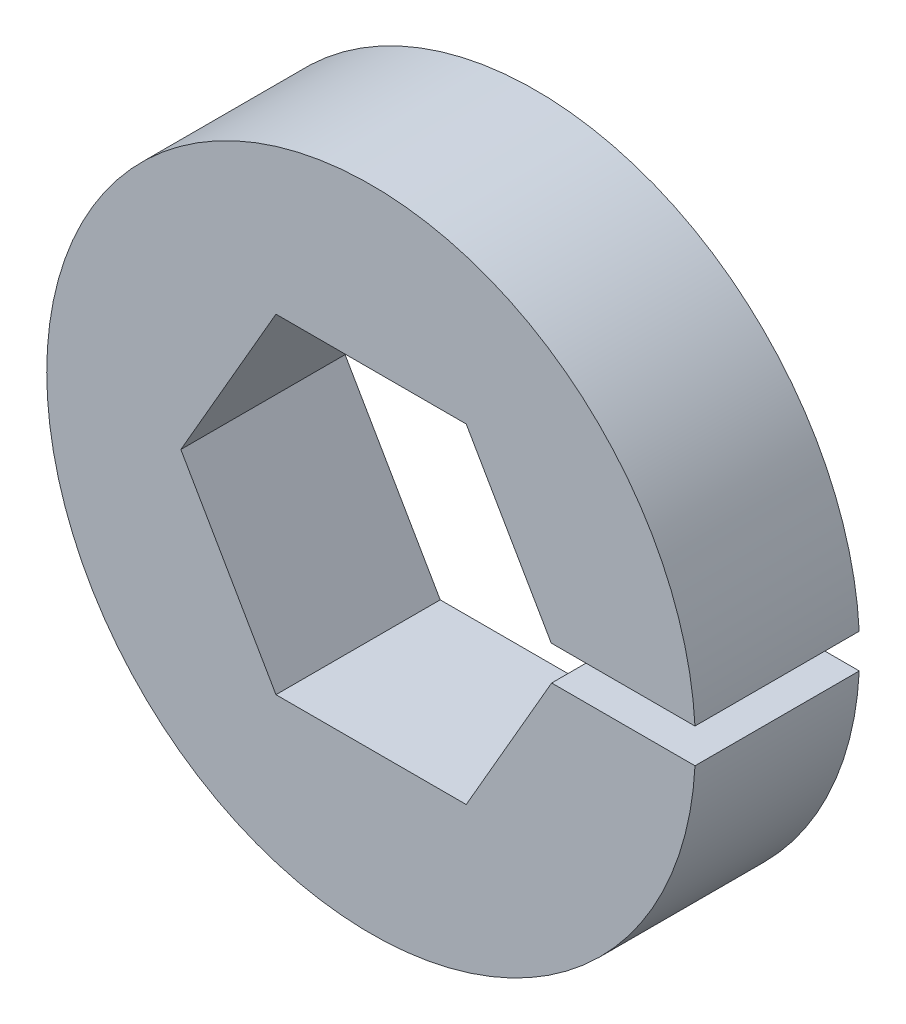
ISO-10303-21;
HEADER;
FILE_DESCRIPTION(('STEP AP214'),'2;1');
FILE_NAME('part.step','',(''),(''),'','','');
FILE_SCHEMA(('AUTOMOTIVE_DESIGN { 1 0 10303 214 1 1 1 1 }'));
ENDSEC;
DATA;
#1=APPLICATION_CONTEXT('core data for automotive mechanical design processes');
#2=APPLICATION_PROTOCOL_DEFINITION('international standard','automotive_design',2000,#1);
#3=PRODUCT_CONTEXT('',#1,'mechanical');
#4=PRODUCT('Part','Part','',(#3));
#5=PRODUCT_RELATED_PRODUCT_CATEGORY('part','',(#4));
#6=PRODUCT_DEFINITION_FORMATION('','',#4);
#7=PRODUCT_DEFINITION_CONTEXT('part definition',#1,'design');
#8=PRODUCT_DEFINITION('design','',#6,#7);
#9=PRODUCT_DEFINITION_SHAPE('','',#8);
#10=(LENGTH_UNIT() NAMED_UNIT(*) SI_UNIT(.MILLI.,.METRE.));
#11=(NAMED_UNIT(*) PLANE_ANGLE_UNIT() SI_UNIT($,.RADIAN.));
#12=(NAMED_UNIT(*) SI_UNIT($,.STERADIAN.) SOLID_ANGLE_UNIT());
#13=UNCERTAINTY_MEASURE_WITH_UNIT(LENGTH_MEASURE(1.E-05),#10,'distance_accuracy_value','');
#14=(GEOMETRIC_REPRESENTATION_CONTEXT(3) GLOBAL_UNCERTAINTY_ASSIGNED_CONTEXT((#13)) GLOBAL_UNIT_ASSIGNED_CONTEXT((#10,
#11,#12)) REPRESENTATION_CONTEXT('',''));
#15=CARTESIAN_POINT('',(0.,0.,0.));
#16=DIRECTION('',(0.,0.,1.));
#17=DIRECTION('',(1.,0.,0.));
#18=AXIS2_PLACEMENT_3D('',#15,#16,#17);
#19=CARTESIAN_POINT('',(0.,0.,6.33));
#20=DIRECTION('',(0.,0.,1.));
#21=DIRECTION('',(1.,0.,0.));
#22=AXIS2_PLACEMENT_3D('',#19,#20,#21);
#23=PLANE('',#22);
#24=DIRECTION('',(1.,0.,0.));
#25=VECTOR('',#24,1.);
#26=CARTESIAN_POINT('',(6.196229826958,-0.647680203586631,6.33));
#27=LINE('',#26,#25);
#28=CARTESIAN_POINT('',(6.95841007881871,-0.647680203586631,6.33));
#29=VERTEX_POINT('',#28);
#30=CARTESIAN_POINT('',(12.4832091368318,-0.647680203586631,6.33));
#31=VERTEX_POINT('',#30);
#32=EDGE_CURVE('E125',#29,#31,#27,.T.);
#33=ORIENTED_EDGE('',*,*,#32,.F.);
#34=DIRECTION('',(0.499999999999995,0.866025403784442,0.));
#35=VECTOR('',#34,1.);
#36=CARTESIAN_POINT('',(3.66617420935419,-6.34999999999995,6.33));
#37=LINE('',#36,#35);
#38=CARTESIAN_POINT('',(3.66617420935419,-6.34999999999995,6.33));
#39=VERTEX_POINT('',#38);
#40=EDGE_CURVE('E150',#39,#29,#37,.T.);
#41=ORIENTED_EDGE('',*,*,#40,.F.);
#42=DIRECTION('',(1.,0.,0.));
#43=VECTOR('',#42,1.);
#44=CARTESIAN_POINT('',(-3.66617420935406,-6.35000000000003,6.33));
#45=LINE('',#44,#43);
#46=CARTESIAN_POINT('',(-3.66617420935406,-6.35000000000003,6.33));
#47=VERTEX_POINT('',#46);
#48=EDGE_CURVE('E142',#47,#39,#45,.T.);
#49=ORIENTED_EDGE('',*,*,#48,.F.);
#50=DIRECTION('',(0.500000000000007,-0.866025403784434,0.));
#51=VECTOR('',#50,1.);
#52=CARTESIAN_POINT('',(-7.33234841870824,0.,6.33));
#53=LINE('',#52,#51);
#54=CARTESIAN_POINT('',(-7.33234841870824,0.,6.33));
#55=VERTEX_POINT('',#54);
#56=EDGE_CURVE('E161',#55,#47,#53,.T.);
#57=ORIENTED_EDGE('',*,*,#56,.F.);
#58=DIRECTION('',(-0.499999999999995,-0.866025403784441,0.));
#59=VECTOR('',#58,1.);
#60=CARTESIAN_POINT('',(-3.66617420935415,6.34999999999998,6.33));
#61=LINE('',#60,#59);
#62=CARTESIAN_POINT('',(-3.66617420935415,6.34999999999998,6.33));
#63=VERTEX_POINT('',#62);
#64=EDGE_CURVE('E168',#63,#55,#61,.T.);
#65=ORIENTED_EDGE('',*,*,#64,.F.);
#66=DIRECTION('',(-1.,0.,0.));
#67=VECTOR('',#66,1.);
#68=CARTESIAN_POINT('',(3.6661742093541,6.35,6.33));
#69=LINE('',#68,#67);
#70=CARTESIAN_POINT('',(3.6661742093541,6.35,6.33));
#71=VERTEX_POINT('',#70);
#72=EDGE_CURVE('E166',#71,#63,#69,.T.);
#73=ORIENTED_EDGE('',*,*,#72,.F.);
#74=DIRECTION('',(-0.500000000000001,0.866025403784438,0.));
#75=VECTOR('',#74,1.);
#76=CARTESIAN_POINT('',(7.33234841870824,0.,6.33));
#77=LINE('',#76,#75);
#78=CARTESIAN_POINT('',(6.94190411265604,0.676269375608385,6.33));
#79=VERTEX_POINT('',#78);
#80=EDGE_CURVE('E121',#79,#71,#77,.T.);
#81=ORIENTED_EDGE('',*,*,#80,.F.);
#82=DIRECTION('',(-1.,0.,0.));
#83=VECTOR('',#82,1.);
#84=CARTESIAN_POINT('',(6.196229826958,0.676269375608385,6.33));
#85=LINE('',#84,#83);
#86=CARTESIAN_POINT('',(12.4816929833903,0.676269375608385,6.33));
#87=VERTEX_POINT('',#86);
#88=EDGE_CURVE('E63',#87,#79,#85,.T.);
#89=ORIENTED_EDGE('',*,*,#88,.F.);
#90=CARTESIAN_POINT('',(0.,0.,6.33));
#91=DIRECTION('',(0.,0.,1.));
#92=DIRECTION('',(1.,0.,0.));
#93=AXIS2_PLACEMENT_3D('',#90,#91,#92);
#94=CIRCLE('',#93,12.5);
#95=EDGE_CURVE('E123',#87,#31,#94,.T.);
#96=ORIENTED_EDGE('',*,*,#95,.T.);
#97=EDGE_LOOP('',(#33,#41,#49,#57,#65,#73,#81,#89,#96));
#98=FACE_BOUND('',#97,.T.);
#99=ADVANCED_FACE('F39',(#98),#23,.T.);
#100=CARTESIAN_POINT('',(0.,0.,0.));
#101=DIRECTION('',(0.,0.,1.));
#102=DIRECTION('',(1.,0.,0.));
#103=AXIS2_PLACEMENT_3D('',#100,#101,#102);
#104=PLANE('',#103);
#105=CARTESIAN_POINT('',(0.,0.,0.));
#106=DIRECTION('',(0.,0.,1.));
#107=DIRECTION('',(1.,0.,0.));
#108=AXIS2_PLACEMENT_3D('',#105,#106,#107);
#109=CIRCLE('',#108,12.5);
#110=CARTESIAN_POINT('',(12.4816929833903,0.676269375608385,0.));
#111=VERTEX_POINT('',#110);
#112=CARTESIAN_POINT('',(12.4832091368318,-0.647680203586631,0.));
#113=VERTEX_POINT('',#112);
#114=EDGE_CURVE('E130',#111,#113,#109,.T.);
#115=ORIENTED_EDGE('',*,*,#114,.F.);
#116=DIRECTION('',(-1.,0.,0.));
#117=VECTOR('',#116,1.);
#118=CARTESIAN_POINT('',(6.196229826958,0.676269375608385,0.));
#119=LINE('',#118,#117);
#120=CARTESIAN_POINT('',(6.94190411265604,0.676269375608385,0.));
#121=VERTEX_POINT('',#120);
#122=EDGE_CURVE('E109',#111,#121,#119,.T.);
#123=ORIENTED_EDGE('',*,*,#122,.T.);
#124=DIRECTION('',(-0.500000000000001,0.866025403784438,0.));
#125=VECTOR('',#124,1.);
#126=CARTESIAN_POINT('',(7.33234841870824,0.,0.));
#127=LINE('',#126,#125);
#128=CARTESIAN_POINT('',(3.6661742093541,6.35,0.));
#129=VERTEX_POINT('',#128);
#130=EDGE_CURVE('E160',#121,#129,#127,.T.);
#131=ORIENTED_EDGE('',*,*,#130,.T.);
#132=DIRECTION('',(-1.,0.,0.));
#133=VECTOR('',#132,1.);
#134=CARTESIAN_POINT('',(3.6661742093541,6.35,0.));
#135=LINE('',#134,#133);
#136=CARTESIAN_POINT('',(-3.66617420935415,6.34999999999998,0.));
#137=VERTEX_POINT('',#136);
#138=EDGE_CURVE('E152',#129,#137,#135,.T.);
#139=ORIENTED_EDGE('',*,*,#138,.T.);
#140=DIRECTION('',(-0.499999999999995,-0.866025403784441,0.));
#141=VECTOR('',#140,1.);
#142=CARTESIAN_POINT('',(-3.66617420935415,6.34999999999998,0.));
#143=LINE('',#142,#141);
#144=CARTESIAN_POINT('',(-7.33234841870824,0.,0.));
#145=VERTEX_POINT('',#144);
#146=EDGE_CURVE('E153',#137,#145,#143,.T.);
#147=ORIENTED_EDGE('',*,*,#146,.T.);
#148=DIRECTION('',(0.500000000000007,-0.866025403784434,0.));
#149=VECTOR('',#148,1.);
#150=CARTESIAN_POINT('',(-7.33234841870824,0.,0.));
#151=LINE('',#150,#149);
#152=CARTESIAN_POINT('',(-3.66617420935406,-6.35000000000003,0.));
#153=VERTEX_POINT('',#152);
#154=EDGE_CURVE('E149',#145,#153,#151,.T.);
#155=ORIENTED_EDGE('',*,*,#154,.T.);
#156=DIRECTION('',(1.,0.,0.));
#157=VECTOR('',#156,1.);
#158=CARTESIAN_POINT('',(-3.66617420935406,-6.35000000000003,0.));
#159=LINE('',#158,#157);
#160=CARTESIAN_POINT('',(3.66617420935419,-6.34999999999995,0.));
#161=VERTEX_POINT('',#160);
#162=EDGE_CURVE('E143',#153,#161,#159,.T.);
#163=ORIENTED_EDGE('',*,*,#162,.T.);
#164=DIRECTION('',(0.499999999999995,0.866025403784442,0.));
#165=VECTOR('',#164,1.);
#166=CARTESIAN_POINT('',(3.66617420935419,-6.34999999999995,0.));
#167=LINE('',#166,#165);
#168=CARTESIAN_POINT('',(6.95841007881871,-0.64768020358663,0.));
#169=VERTEX_POINT('',#168);
#170=EDGE_CURVE('E159',#161,#169,#167,.T.);
#171=ORIENTED_EDGE('',*,*,#170,.T.);
#172=DIRECTION('',(1.,0.,0.));
#173=VECTOR('',#172,1.);
#174=CARTESIAN_POINT('',(6.196229826958,-0.647680203586631,0.));
#175=LINE('',#174,#173);
#176=EDGE_CURVE('E52',#169,#113,#175,.T.);
#177=ORIENTED_EDGE('',*,*,#176,.T.);
#178=EDGE_LOOP('',(#115,#123,#131,#139,#147,#155,#163,#171,#177));
#179=FACE_BOUND('',#178,.T.);
#180=ADVANCED_FACE('F180',(#179),#104,.F.);
#181=CARTESIAN_POINT('',(0.,0.,6.33));
#182=DIRECTION('',(0.,0.,-1.));
#183=DIRECTION('',(-1.,0.,0.));
#184=AXIS2_PLACEMENT_3D('',#181,#182,#183);
#185=CYLINDRICAL_SURFACE('',#184,12.5);
#186=ORIENTED_EDGE('',*,*,#95,.F.);
#187=DIRECTION('',(0.,0.,-1.));
#188=VECTOR('',#187,1.);
#189=CARTESIAN_POINT('',(12.4816929833903,0.676269375608385,6.33));
#190=LINE('',#189,#188);
#191=EDGE_CURVE('E110',#87,#111,#190,.T.);
#192=ORIENTED_EDGE('',*,*,#191,.T.);
#193=ORIENTED_EDGE('',*,*,#114,.T.);
#194=DIRECTION('',(0.,0.,-1.));
#195=VECTOR('',#194,1.);
#196=CARTESIAN_POINT('',(12.4832091368318,-0.647680203586631,6.33));
#197=LINE('',#196,#195);
#198=EDGE_CURVE('E113',#113,#31,#197,.F.);
#199=ORIENTED_EDGE('',*,*,#198,.T.);
#200=EDGE_LOOP('',(#186,#192,#193,#199));
#201=FACE_BOUND('',#200,.T.);
#202=ADVANCED_FACE('F41',(#201),#185,.T.);
#203=CARTESIAN_POINT('',(3.66617420935419,-6.34999999999995,6.33));
#204=DIRECTION('',(-0.866025403784441,0.499999999999995,0.));
#205=DIRECTION('',(-0.499999999999995,-0.866025403784441,0.));
#206=AXIS2_PLACEMENT_3D('',#203,#204,#205);
#207=PLANE('',#206);
#208=DIRECTION('',(0.,0.,1.));
#209=VECTOR('',#208,1.);
#210=CARTESIAN_POINT('',(6.95841007881871,-0.647680203586631,6.33));
#211=LINE('',#210,#209);
#212=EDGE_CURVE('E11',#169,#29,#211,.T.);
#213=ORIENTED_EDGE('',*,*,#212,.F.);
#214=ORIENTED_EDGE('',*,*,#170,.F.);
#215=DIRECTION('',(0.,0.,-1.));
#216=VECTOR('',#215,1.);
#217=CARTESIAN_POINT('',(3.66617420935419,-6.34999999999995,6.33));
#218=LINE('',#217,#216);
#219=EDGE_CURVE('E139',#39,#161,#218,.T.);
#220=ORIENTED_EDGE('',*,*,#219,.F.);
#221=ORIENTED_EDGE('',*,*,#40,.T.);
#222=EDGE_LOOP('',(#213,#214,#220,#221));
#223=FACE_BOUND('',#222,.T.);
#224=ADVANCED_FACE('F181',(#223),#207,.T.);
#225=CARTESIAN_POINT('',(7.33234841870824,0.,6.33));
#226=DIRECTION('',(-0.866025403784438,-0.500000000000001,0.));
#227=DIRECTION('',(0.500000000000001,-0.866025403784438,0.));
#228=AXIS2_PLACEMENT_3D('',#225,#226,#227);
#229=PLANE('',#228);
#230=DIRECTION('',(0.,0.,-1.));
#231=VECTOR('',#230,1.);
#232=CARTESIAN_POINT('',(6.94190411265604,0.676269375608385,6.33));
#233=LINE('',#232,#231);
#234=EDGE_CURVE('E50',#79,#121,#233,.T.);
#235=ORIENTED_EDGE('',*,*,#234,.F.);
#236=ORIENTED_EDGE('',*,*,#80,.T.);
#237=DIRECTION('',(0.,0.,-1.));
#238=VECTOR('',#237,1.);
#239=CARTESIAN_POINT('',(3.6661742093541,6.35,6.33));
#240=LINE('',#239,#238);
#241=EDGE_CURVE('E129',#71,#129,#240,.T.);
#242=ORIENTED_EDGE('',*,*,#241,.T.);
#243=ORIENTED_EDGE('',*,*,#130,.F.);
#244=EDGE_LOOP('',(#235,#236,#242,#243));
#245=FACE_BOUND('',#244,.T.);
#246=ADVANCED_FACE('F203',(#245),#229,.T.);
#247=CARTESIAN_POINT('',(3.6661742093541,6.35,6.33));
#248=DIRECTION('',(0.,-1.,0.));
#249=DIRECTION('',(1.,0.,0.));
#250=AXIS2_PLACEMENT_3D('',#247,#248,#249);
#251=PLANE('',#250);
#252=ORIENTED_EDGE('',*,*,#138,.F.);
#253=ORIENTED_EDGE('',*,*,#241,.F.);
#254=ORIENTED_EDGE('',*,*,#72,.T.);
#255=DIRECTION('',(0.,0.,-1.));
#256=VECTOR('',#255,1.);
#257=CARTESIAN_POINT('',(-3.66617420935415,6.34999999999998,6.33));
#258=LINE('',#257,#256);
#259=EDGE_CURVE('E132',#63,#137,#258,.T.);
#260=ORIENTED_EDGE('',*,*,#259,.T.);
#261=EDGE_LOOP('',(#252,#253,#254,#260));
#262=FACE_BOUND('',#261,.T.);
#263=ADVANCED_FACE('F206',(#262),#251,.T.);
#264=CARTESIAN_POINT('',(-3.66617420935415,6.34999999999998,6.33));
#265=DIRECTION('',(0.866025403784442,-0.499999999999995,0.));
#266=DIRECTION('',(0.499999999999995,0.866025403784442,0.));
#267=AXIS2_PLACEMENT_3D('',#264,#265,#266);
#268=PLANE('',#267);
#269=ORIENTED_EDGE('',*,*,#146,.F.);
#270=ORIENTED_EDGE('',*,*,#259,.F.);
#271=ORIENTED_EDGE('',*,*,#64,.T.);
#272=DIRECTION('',(0.,0.,-1.));
#273=VECTOR('',#272,1.);
#274=CARTESIAN_POINT('',(-7.33234841870824,0.,6.33));
#275=LINE('',#274,#273);
#276=EDGE_CURVE('E136',#55,#145,#275,.T.);
#277=ORIENTED_EDGE('',*,*,#276,.T.);
#278=EDGE_LOOP('',(#269,#270,#271,#277));
#279=FACE_BOUND('',#278,.T.);
#280=ADVANCED_FACE('F212',(#279),#268,.T.);
#281=CARTESIAN_POINT('',(-7.33234841870824,0.,6.33));
#282=DIRECTION('',(0.866025403784435,0.500000000000007,0.));
#283=DIRECTION('',(-0.500000000000007,0.866025403784435,0.));
#284=AXIS2_PLACEMENT_3D('',#281,#282,#283);
#285=PLANE('',#284);
#286=ORIENTED_EDGE('',*,*,#154,.F.);
#287=ORIENTED_EDGE('',*,*,#276,.F.);
#288=ORIENTED_EDGE('',*,*,#56,.T.);
#289=DIRECTION('',(0.,0.,-1.));
#290=VECTOR('',#289,1.);
#291=CARTESIAN_POINT('',(-3.66617420935406,-6.35000000000003,6.33));
#292=LINE('',#291,#290);
#293=EDGE_CURVE('E138',#47,#153,#292,.T.);
#294=ORIENTED_EDGE('',*,*,#293,.T.);
#295=EDGE_LOOP('',(#286,#287,#288,#294));
#296=FACE_BOUND('',#295,.T.);
#297=ADVANCED_FACE('F218',(#296),#285,.T.);
#298=CARTESIAN_POINT('',(-3.66617420935406,-6.35000000000003,6.33));
#299=DIRECTION('',(0.,1.,0.));
#300=DIRECTION('',(-1.,0.,0.));
#301=AXIS2_PLACEMENT_3D('',#298,#299,#300);
#302=PLANE('',#301);
#303=ORIENTED_EDGE('',*,*,#162,.F.);
#304=ORIENTED_EDGE('',*,*,#293,.F.);
#305=ORIENTED_EDGE('',*,*,#48,.T.);
#306=ORIENTED_EDGE('',*,*,#219,.T.);
#307=EDGE_LOOP('',(#303,#304,#305,#306));
#308=FACE_BOUND('',#307,.T.);
#309=ADVANCED_FACE('F182',(#308),#302,.T.);
#310=CARTESIAN_POINT('',(6.196229826958,0.676269375608385,0.));
#311=DIRECTION('',(0.,1.,0.));
#312=DIRECTION('',(0.,0.,1.));
#313=AXIS2_PLACEMENT_3D('',#310,#311,#312);
#314=PLANE('',#313);
#315=ORIENTED_EDGE('',*,*,#88,.T.);
#316=ORIENTED_EDGE('',*,*,#234,.T.);
#317=ORIENTED_EDGE('',*,*,#122,.F.);
#318=ORIENTED_EDGE('',*,*,#191,.F.);
#319=EDGE_LOOP('',(#315,#316,#317,#318));
#320=FACE_BOUND('',#319,.T.);
#321=ADVANCED_FACE('F106',(#320),#314,.F.);
#322=CARTESIAN_POINT('',(6.196229826958,-0.647680203586631,0.));
#323=DIRECTION('',(0.,-1.,0.));
#324=DIRECTION('',(0.,0.,-1.));
#325=AXIS2_PLACEMENT_3D('',#322,#323,#324);
#326=PLANE('',#325);
#327=ORIENTED_EDGE('',*,*,#176,.F.);
#328=ORIENTED_EDGE('',*,*,#212,.T.);
#329=ORIENTED_EDGE('',*,*,#32,.T.);
#330=ORIENTED_EDGE('',*,*,#198,.F.);
#331=EDGE_LOOP('',(#327,#328,#329,#330));
#332=FACE_BOUND('',#331,.T.);
#333=ADVANCED_FACE('F187',(#332),#326,.F.);
#334=CLOSED_SHELL('',(#99,#180,#202,#224,#246,#263,#280,#297,#309,#321,#333));
#335=MANIFOLD_SOLID_BREP('B2',#334);
#336=ADVANCED_BREP_SHAPE_REPRESENTATION('',(#18,#335),#14);
#337=SHAPE_DEFINITION_REPRESENTATION(#9,#336);
ENDSEC;
END-ISO-10303-21;
